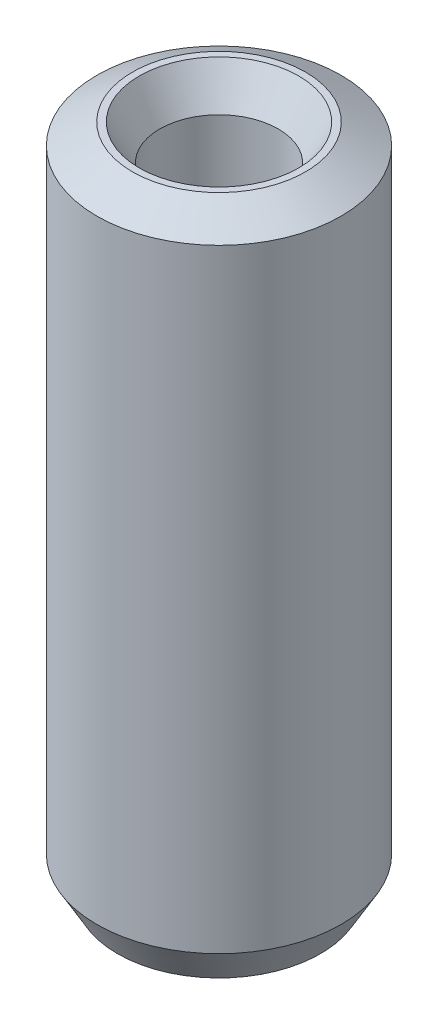
ISO-10303-21;
HEADER;
FILE_DESCRIPTION(('STEP AP214'),'2;1');
FILE_NAME('part.step','',(''),(''),'','','');
FILE_SCHEMA(('AUTOMOTIVE_DESIGN { 1 0 10303 214 1 1 1 1 }'));
ENDSEC;
DATA;
#1=APPLICATION_CONTEXT('core data for automotive mechanical design processes');
#2=APPLICATION_PROTOCOL_DEFINITION('international standard','automotive_design',2000,#1);
#3=PRODUCT_CONTEXT('',#1,'mechanical');
#4=PRODUCT('Part','Part','',(#3));
#5=PRODUCT_RELATED_PRODUCT_CATEGORY('part','',(#4));
#6=PRODUCT_DEFINITION_FORMATION('','',#4);
#7=PRODUCT_DEFINITION_CONTEXT('part definition',#1,'design');
#8=PRODUCT_DEFINITION('design','',#6,#7);
#9=PRODUCT_DEFINITION_SHAPE('','',#8);
#10=(LENGTH_UNIT() NAMED_UNIT(*) SI_UNIT(.MILLI.,.METRE.));
#11=(NAMED_UNIT(*) PLANE_ANGLE_UNIT() SI_UNIT($,.RADIAN.));
#12=(NAMED_UNIT(*) SI_UNIT($,.STERADIAN.) SOLID_ANGLE_UNIT());
#13=UNCERTAINTY_MEASURE_WITH_UNIT(LENGTH_MEASURE(1.E-05),#10,'distance_accuracy_value','');
#14=(GEOMETRIC_REPRESENTATION_CONTEXT(3) GLOBAL_UNCERTAINTY_ASSIGNED_CONTEXT((#13)) GLOBAL_UNIT_ASSIGNED_CONTEXT((#10,
#11,#12)) REPRESENTATION_CONTEXT('',''));
#15=CARTESIAN_POINT('',(0.,0.,0.));
#16=DIRECTION('',(0.,0.,1.));
#17=DIRECTION('',(1.,0.,0.));
#18=AXIS2_PLACEMENT_3D('',#15,#16,#17);
#19=CARTESIAN_POINT('',(0.,95.9807842280937,0.));
#20=DIRECTION('',(0.,-1.,0.));
#21=DIRECTION('',(0.,0.,-1.));
#22=AXIS2_PLACEMENT_3D('',#19,#20,#21);
#23=CYLINDRICAL_SURFACE('',#22,17.5);
#24=CARTESIAN_POINT('',(0.,5.09988005060051,0.));
#25=DIRECTION('',(0.,1.,0.));
#26=DIRECTION('',(0.,0.,1.));
#27=AXIS2_PLACEMENT_3D('',#24,#25,#26);
#28=CIRCLE('',#27,17.5);
#29=CARTESIAN_POINT('',(0.,5.09988005060051,-17.5));
#30=VERTEX_POINT('',#29);
#31=EDGE_CURVE('E10',#30,#30,#28,.T.);
#32=CARTESIAN_POINT('',(0.,93.0363671080448,0.));
#33=DIRECTION('',(0.,1.,0.));
#34=DIRECTION('',(0.,0.,1.));
#35=AXIS2_PLACEMENT_3D('',#32,#33,#34);
#36=CIRCLE('',#35,17.5);
#37=CARTESIAN_POINT('',(0.,93.0363671080448,-17.5));
#38=VERTEX_POINT('',#37);
#39=EDGE_CURVE('E50',#38,#38,#36,.F.);
#40=CARTESIAN_POINT('',(0.,5.09988005060051,-17.5));
#41=CARTESIAN_POINT('',(0.,6.01588512411555,-17.5));
#42=CARTESIAN_POINT('',(0.,6.9318901976306,-17.5));
#43=CARTESIAN_POINT('',(0.,8.76390034466069,-17.5));
#44=CARTESIAN_POINT('',(0.,9.67990541817573,-17.5));
#45=CARTESIAN_POINT('',(0.,11.5119155652058,-17.5));
#46=CARTESIAN_POINT('',(0.,12.4279206387209,-17.5));
#47=CARTESIAN_POINT('',(0.,14.259930785751,-17.5));
#48=CARTESIAN_POINT('',(0.,15.175935859266,-17.5));
#49=CARTESIAN_POINT('',(0.,17.0079460062961,-17.5));
#50=CARTESIAN_POINT('',(0.,17.9239510798111,-17.5));
#51=CARTESIAN_POINT('',(0.,19.7559612268412,-17.5));
#52=CARTESIAN_POINT('',(0.,20.6719663003563,-17.5));
#53=CARTESIAN_POINT('',(0.,22.5039764473864,-17.5));
#54=CARTESIAN_POINT('',(0.,23.4199815209014,-17.5));
#55=CARTESIAN_POINT('',(0.,25.2519916679315,-17.5));
#56=CARTESIAN_POINT('',(0.,26.1679967414465,-17.5));
#57=CARTESIAN_POINT('',(0.,28.0000068884766,-17.5));
#58=CARTESIAN_POINT('',(0.,28.9160119619917,-17.5));
#59=CARTESIAN_POINT('',(0.,30.7480221090218,-17.5));
#60=CARTESIAN_POINT('',(0.,31.6640271825368,-17.5));
#61=CARTESIAN_POINT('',(0.,33.4960373295669,-17.5));
#62=CARTESIAN_POINT('',(0.,34.4120424030819,-17.5));
#63=CARTESIAN_POINT('',(0.,36.244052550112,-17.5));
#64=CARTESIAN_POINT('',(0.,37.1600576236271,-17.5));
#65=CARTESIAN_POINT('',(0.,38.9920677706572,-17.5));
#66=CARTESIAN_POINT('',(0.,39.9080728441722,-17.5));
#67=CARTESIAN_POINT('',(0.,41.7400829912023,-17.5));
#68=CARTESIAN_POINT('',(0.,42.6560880647173,-17.5));
#69=CARTESIAN_POINT('',(0.,44.4880982117474,-17.5));
#70=CARTESIAN_POINT('',(0.,45.4041032852625,-17.5));
#71=CARTESIAN_POINT('',(0.,47.2361134322926,-17.5));
#72=CARTESIAN_POINT('',(0.,48.1521185058076,-17.5));
#73=CARTESIAN_POINT('',(0.,49.9841286528377,-17.5));
#74=CARTESIAN_POINT('',(0.,50.9001337263527,-17.5));
#75=CARTESIAN_POINT('',(0.,52.7321438733828,-17.5));
#76=CARTESIAN_POINT('',(0.,53.6481489468979,-17.5));
#77=CARTESIAN_POINT('',(0.,55.480159093928,-17.5));
#78=CARTESIAN_POINT('',(0.,56.396164167443,-17.5));
#79=CARTESIAN_POINT('',(0.,58.2281743144731,-17.5));
#80=CARTESIAN_POINT('',(0.,59.1441793879881,-17.5));
#81=CARTESIAN_POINT('',(0.,60.9761895350182,-17.5));
#82=CARTESIAN_POINT('',(0.,61.8921946085333,-17.5));
#83=CARTESIAN_POINT('',(0.,63.7242047555633,-17.5));
#84=CARTESIAN_POINT('',(0.,64.6402098290784,-17.5));
#85=CARTESIAN_POINT('',(0.,66.4722199761085,-17.5));
#86=CARTESIAN_POINT('',(0.,67.3882250496235,-17.5));
#87=CARTESIAN_POINT('',(0.,69.2202351966536,-17.5));
#88=CARTESIAN_POINT('',(0.,70.1362402701687,-17.5));
#89=CARTESIAN_POINT('',(0.,71.9682504171987,-17.5));
#90=CARTESIAN_POINT('',(0.,72.8842554907138,-17.5));
#91=CARTESIAN_POINT('',(0.,74.7162656377439,-17.5));
#92=CARTESIAN_POINT('',(0.,75.6322707112589,-17.5));
#93=CARTESIAN_POINT('',(0.,77.464280858289,-17.5));
#94=CARTESIAN_POINT('',(0.,78.3802859318041,-17.5));
#95=CARTESIAN_POINT('',(0.,80.2122960788341,-17.5));
#96=CARTESIAN_POINT('',(0.,81.1283011523492,-17.5));
#97=CARTESIAN_POINT('',(0.,82.9603112993793,-17.5));
#98=CARTESIAN_POINT('',(0.,83.8763163728943,-17.5));
#99=CARTESIAN_POINT('',(0.,85.7083265199244,-17.5));
#100=CARTESIAN_POINT('',(0.,86.6243315934395,-17.5));
#101=CARTESIAN_POINT('',(0.,88.4563417404695,-17.5));
#102=CARTESIAN_POINT('',(0.,89.3723468139846,-17.5));
#103=CARTESIAN_POINT('',(0.,91.2043569610147,-17.5));
#104=CARTESIAN_POINT('',(0.,92.1203620345297,-17.5));
#105=CARTESIAN_POINT('',(0.,93.0363671080448,-17.5));
#106=B_SPLINE_CURVE_WITH_KNOTS('',3,(#40,#41,#42,#43,#44,#45,#46,#47,#48,#49,#50,#51,#52,#53,
#54,#55,#56,#57,#58,#59,#60,#61,#62,#63,#64,#65,#66,#67,#68,#69,#70,#71,#72,#73,#74,#75,#76,#77,
#78,#79,#80,#81,#82,#83,#84,#85,#86,#87,#88,#89,#90,#91,#92,#93,#94,#95,#96,#97,#98,#99,#100,
#101,#102,#103,#104,#105),.UNSPECIFIED.,.F.,.F.,(4,2,2,2,2,2,2,2,2,2,2,2,2,2,2,2,2,2,2,2,2,2,2,
2,2,2,2,2,2,2,2,2,4),(0.,2.74801522054513,5.49603044109026,8.2440456616354,10.9920608821805,
13.7400761027257,16.4880913232708,19.2361065438159,21.9841217643611,24.7321369849062,
27.4801522054513,30.2281674259965,32.9761826465416,35.7241978670867,38.4722130876319,
41.220228308177,43.9682435287221,46.7162587492673,49.4642739698124,52.2122891903575,
54.9603044109027,57.7083196314478,60.4563348519929,63.204350072538,65.9523652930832,
68.7003805136283,71.4483957341735,74.1964109547186,76.9444261752637,79.6924413958088,
82.440456616354,85.1884718368991,87.9364870574443),.UNSPECIFIED.);
#107=EDGE_CURVE('BSEAM39',#30,#38,#106,.T.);
#108=ORIENTED_EDGE('',*,*,#31,.T.);
#109=ORIENTED_EDGE('',*,*,#39,.T.);
#110=ORIENTED_EDGE('',*,*,#107,.T.);
#111=ORIENTED_EDGE('',*,*,#107,.F.);
#112=EDGE_LOOP('',(#108,#110,#109,#111));
#113=FACE_BOUND('',#112,.T.);
#114=ADVANCED_FACE('F39',(#113),#23,.T.);
#115=CARTESIAN_POINT('',(0.,95.9807842280937,0.));
#116=DIRECTION('',(0.,1.,0.));
#117=DIRECTION('',(0.,0.,1.));
#118=AXIS2_PLACEMENT_3D('',#115,#116,#117);
#119=PLANE('',#118);
#120=CARTESIAN_POINT('',(0.,95.9807842280937,0.));
#121=DIRECTION('',(0.,1.,0.));
#122=DIRECTION('',(0.,0.,1.));
#123=AXIS2_PLACEMENT_3D('',#120,#121,#122);
#124=CIRCLE('',#123,11.4274088536523);
#125=CARTESIAN_POINT('',(0.,95.9807842280937,11.4274088536523));
#126=VERTEX_POINT('',#125);
#127=EDGE_CURVE('E58',#126,#126,#124,.F.);
#128=ORIENTED_EDGE('',*,*,#127,.T.);
#129=EDGE_LOOP('',(#128));
#130=FACE_BOUND('',#129,.T.);
#131=CARTESIAN_POINT('',(0.,95.9807842280937,0.));
#132=DIRECTION('',(0.,1.,0.));
#133=DIRECTION('',(0.,0.,1.));
#134=AXIS2_PLACEMENT_3D('',#131,#132,#133);
#135=CIRCLE('',#134,12.4001199493998);
#136=CARTESIAN_POINT('',(0.,95.9807842280937,12.4001199493998));
#137=VERTEX_POINT('',#136);
#138=EDGE_CURVE('E61',#137,#137,#135,.T.);
#139=ORIENTED_EDGE('',*,*,#138,.T.);
#140=EDGE_LOOP('',(#139));
#141=FACE_BOUND('',#140,.T.);
#142=ADVANCED_FACE('F88',(#130,#141),#119,.T.);
#143=CARTESIAN_POINT('',(0.,0.,0.));
#144=DIRECTION('',(0.,1.,0.));
#145=DIRECTION('',(0.,0.,1.));
#146=AXIS2_PLACEMENT_3D('',#143,#144,#145);
#147=PLANE('',#146);
#148=CARTESIAN_POINT('',(0.,0.,0.));
#149=DIRECTION('',(0.,1.,0.));
#150=DIRECTION('',(0.,0.,1.));
#151=AXIS2_PLACEMENT_3D('',#148,#149,#150);
#152=CIRCLE('',#151,13.5828717842035);
#153=CARTESIAN_POINT('',(0.,0.,13.5828717842035));
#154=VERTEX_POINT('',#153);
#155=EDGE_CURVE('E51',#154,#154,#152,.T.);
#156=ORIENTED_EDGE('',*,*,#155,.T.);
#157=EDGE_LOOP('',(#156));
#158=FACE_BOUND('',#157,.T.);
#159=CARTESIAN_POINT('',(0.,0.,0.));
#160=DIRECTION('',(0.,1.,0.));
#161=DIRECTION('',(0.,0.,1.));
#162=AXIS2_PLACEMENT_3D('',#159,#160,#161);
#163=CIRCLE('',#162,14.555582879951);
#164=CARTESIAN_POINT('',(0.,0.,14.555582879951));
#165=VERTEX_POINT('',#164);
#166=EDGE_CURVE('E54',#165,#165,#163,.F.);
#167=ORIENTED_EDGE('',*,*,#166,.T.);
#168=EDGE_LOOP('',(#167));
#169=FACE_BOUND('',#168,.T.);
#170=ADVANCED_FACE('F83',(#158,#169),#147,.F.);
#171=CARTESIAN_POINT('',(0.,95.9807842280937,0.));
#172=DIRECTION('',(0.,-1.,0.));
#173=DIRECTION('',(0.,0.,-1.));
#174=AXIS2_PLACEMENT_3D('',#171,#172,#173);
#175=CYLINDRICAL_SURFACE('',#174,8.48299173360329);
#176=CARTESIAN_POINT('',(0.,90.8809041774932,0.));
#177=DIRECTION('',(0.,1.,0.));
#178=DIRECTION('',(0.,0.,1.));
#179=AXIS2_PLACEMENT_3D('',#176,#177,#178);
#180=CIRCLE('',#179,8.48299173360329);
#181=CARTESIAN_POINT('',(0.,90.8809041774932,-8.48299173360329));
#182=VERTEX_POINT('',#181);
#183=EDGE_CURVE('E67',#182,#182,#180,.T.);
#184=CARTESIAN_POINT('',(0.,2.94441712004889,0.));
#185=DIRECTION('',(0.,1.,0.));
#186=DIRECTION('',(0.,0.,1.));
#187=AXIS2_PLACEMENT_3D('',#184,#185,#186);
#188=CIRCLE('',#187,8.48299173360329);
#189=CARTESIAN_POINT('',(0.,2.94441712004888,-8.48299173360329));
#190=VERTEX_POINT('',#189);
#191=EDGE_CURVE('E69',#190,#190,#188,.F.);
#192=CARTESIAN_POINT('',(0.,90.8809041774932,-8.48299173360329));
#193=CARTESIAN_POINT('',(0.,89.9648991039782,-8.48299173360329));
#194=CARTESIAN_POINT('',(0.,89.0488940304631,-8.48299173360329));
#195=CARTESIAN_POINT('',(0.,87.216883883433,-8.48299173360329));
#196=CARTESIAN_POINT('',(0.,86.300878809918,-8.48299173360329));
#197=CARTESIAN_POINT('',(0.,84.4688686628879,-8.48299173360329));
#198=CARTESIAN_POINT('',(0.,83.5528635893728,-8.48299173360329));
#199=CARTESIAN_POINT('',(0.,81.7208534423428,-8.48299173360329));
#200=CARTESIAN_POINT('',(0.,80.8048483688277,-8.48299173360329));
#201=CARTESIAN_POINT('',(0.,78.9728382217976,-8.48299173360329));
#202=CARTESIAN_POINT('',(0.,78.0568331482826,-8.48299173360329));
#203=CARTESIAN_POINT('',(0.,76.2248230012525,-8.48299173360329));
#204=CARTESIAN_POINT('',(0.,75.3088179277374,-8.48299173360329));
#205=CARTESIAN_POINT('',(0.,73.4768077807073,-8.48299173360329));
#206=CARTESIAN_POINT('',(0.,72.5608027071923,-8.48299173360329));
#207=CARTESIAN_POINT('',(0.,70.7287925601622,-8.48299173360329));
#208=CARTESIAN_POINT('',(0.,69.8127874866472,-8.48299173360329));
#209=CARTESIAN_POINT('',(0.,67.9807773396171,-8.48299173360329));
#210=CARTESIAN_POINT('',(0.,67.064772266102,-8.48299173360329));
#211=CARTESIAN_POINT('',(0.,65.2327621190719,-8.48299173360329));
#212=CARTESIAN_POINT('',(0.,64.3167570455569,-8.48299173360329));
#213=CARTESIAN_POINT('',(0.,62.4847468985268,-8.48299173360329));
#214=CARTESIAN_POINT('',(0.,61.5687418250118,-8.48299173360329));
#215=CARTESIAN_POINT('',(0.,59.7367316779817,-8.48299173360329));
#216=CARTESIAN_POINT('',(0.,58.8207266044666,-8.48299173360329));
#217=CARTESIAN_POINT('',(0.,56.9887164574365,-8.48299173360329));
#218=CARTESIAN_POINT('',(0.,56.0727113839215,-8.48299173360329));
#219=CARTESIAN_POINT('',(0.,54.2407012368914,-8.48299173360329));
#220=CARTESIAN_POINT('',(0.,53.3246961633764,-8.48299173360329));
#221=CARTESIAN_POINT('',(0.,51.4926860163463,-8.48299173360329));
#222=CARTESIAN_POINT('',(0.,50.5766809428312,-8.48299173360329));
#223=CARTESIAN_POINT('',(0.,48.7446707958011,-8.48299173360329));
#224=CARTESIAN_POINT('',(0.,47.8286657222861,-8.48299173360329));
#225=CARTESIAN_POINT('',(0.,45.996655575256,-8.48299173360329));
#226=CARTESIAN_POINT('',(0.,45.080650501741,-8.48299173360329));
#227=CARTESIAN_POINT('',(0.,43.2486403547109,-8.48299173360329));
#228=CARTESIAN_POINT('',(0.,42.3326352811958,-8.48299173360329));
#229=CARTESIAN_POINT('',(0.,40.5006251341657,-8.48299173360329));
#230=CARTESIAN_POINT('',(0.,39.5846200606507,-8.48299173360329));
#231=CARTESIAN_POINT('',(0.,37.7526099136206,-8.48299173360329));
#232=CARTESIAN_POINT('',(0.,36.8366048401056,-8.48299173360329));
#233=CARTESIAN_POINT('',(0.,35.0045946930755,-8.48299173360329));
#234=CARTESIAN_POINT('',(0.,34.0885896195604,-8.48299173360329));
#235=CARTESIAN_POINT('',(0.,32.2565794725303,-8.48299173360329));
#236=CARTESIAN_POINT('',(0.,31.3405743990153,-8.48299173360329));
#237=CARTESIAN_POINT('',(0.,29.5085642519852,-8.48299173360329));
#238=CARTESIAN_POINT('',(0.,28.5925591784701,-8.48299173360329));
#239=CARTESIAN_POINT('',(0.,26.7605490314401,-8.48299173360329));
#240=CARTESIAN_POINT('',(0.,25.844543957925,-8.48299173360329));
#241=CARTESIAN_POINT('',(0.,24.0125338108949,-8.48299173360329));
#242=CARTESIAN_POINT('',(0.,23.0965287373799,-8.48299173360329));
#243=CARTESIAN_POINT('',(0.,21.2645185903498,-8.48299173360329));
#244=CARTESIAN_POINT('',(0.,20.3485135168347,-8.48299173360329));
#245=CARTESIAN_POINT('',(0.,18.5165033698046,-8.48299173360329));
#246=CARTESIAN_POINT('',(0.,17.6004982962896,-8.48299173360329));
#247=CARTESIAN_POINT('',(0.,15.7684881492595,-8.48299173360329));
#248=CARTESIAN_POINT('',(0.,14.8524830757445,-8.48299173360329));
#249=CARTESIAN_POINT('',(0.,13.0204729287144,-8.48299173360329));
#250=CARTESIAN_POINT('',(0.,12.1044678551993,-8.48299173360329));
#251=CARTESIAN_POINT('',(0.,10.2724577081693,-8.48299173360329));
#252=CARTESIAN_POINT('',(0.,9.35645263465421,-8.48299173360329));
#253=CARTESIAN_POINT('',(0.,7.52444248762411,-8.48299173360329));
#254=CARTESIAN_POINT('',(0.,6.60843741410906,-8.48299173360329));
#255=CARTESIAN_POINT('',(0.,4.77642726707897,-8.48299173360329));
#256=CARTESIAN_POINT('',(0.,3.86042219356392,-8.48299173360329));
#257=CARTESIAN_POINT('',(0.,2.94441712004888,-8.48299173360329));
#258=B_SPLINE_CURVE_WITH_KNOTS('',3,(#192,#193,#194,#195,#196,#197,#198,#199,#200,#201,#202,
#203,#204,#205,#206,#207,#208,#209,#210,#211,#212,#213,#214,#215,#216,#217,#218,#219,#220,#221,
#222,#223,#224,#225,#226,#227,#228,#229,#230,#231,#232,#233,#234,#235,#236,#237,#238,#239,#240,
#241,#242,#243,#244,#245,#246,#247,#248,#249,#250,#251,#252,#253,#254,#255,#256,#257),
.UNSPECIFIED.,.F.,.F.,(4,2,2,2,2,2,2,2,2,2,2,2,2,2,2,2,2,2,2,2,2,2,2,2,2,2,2,2,2,2,2,2,4),(0.,
2.74801522054514,5.49603044109027,8.2440456616354,10.9920608821805,13.7400761027257,
16.4880913232708,19.236106543816,21.9841217643611,24.7321369849062,27.4801522054513,
30.2281674259965,32.9761826465416,35.7241978670868,38.4722130876319,41.220228308177,
43.9682435287222,46.7162587492673,49.4642739698124,52.2122891903576,54.9603044109027,
57.7083196314478,60.456334851993,63.2043500725381,65.9523652930832,68.7003805136284,
71.4483957341735,74.1964109547187,76.9444261752638,79.6924413958089,82.440456616354,
85.1884718368992,87.9364870574443),.UNSPECIFIED.);
#259=EDGE_CURVE('BSEAM71',#182,#190,#258,.T.);
#260=ORIENTED_EDGE('',*,*,#183,.T.);
#261=ORIENTED_EDGE('',*,*,#191,.T.);
#262=ORIENTED_EDGE('',*,*,#259,.T.);
#263=ORIENTED_EDGE('',*,*,#259,.F.);
#264=EDGE_LOOP('',(#260,#262,#261,#263));
#265=FACE_BOUND('',#264,.T.);
#266=ADVANCED_FACE('F71',(#265),#175,.F.);
#267=CARTESIAN_POINT('',(0.,90.8809041774932,0.));
#268=DIRECTION('',(0.,1.,0.));
#269=DIRECTION('',(0.,0.,1.));
#270=AXIS2_PLACEMENT_3D('',#267,#268,#269);
#271=CONICAL_SURFACE('',#270,8.48299173360329,0.523598775598304);
#272=ORIENTED_EDGE('',*,*,#127,.F.);
#273=EDGE_LOOP('',(#272));
#274=FACE_BOUND('',#273,.T.);
#275=ORIENTED_EDGE('',*,*,#183,.F.);
#276=EDGE_LOOP('',(#275));
#277=FACE_BOUND('',#276,.T.);
#278=ADVANCED_FACE('F77',(#274,#277),#271,.F.);
#279=CARTESIAN_POINT('',(0.,0.,0.));
#280=DIRECTION('',(0.,-1.,0.));
#281=DIRECTION('',(0.,0.,-1.));
#282=AXIS2_PLACEMENT_3D('',#279,#280,#281);
#283=CONICAL_SURFACE('',#282,13.5828717842035,1.04719755119659);
#284=ORIENTED_EDGE('',*,*,#191,.F.);
#285=EDGE_LOOP('',(#284));
#286=FACE_BOUND('',#285,.T.);
#287=ORIENTED_EDGE('',*,*,#155,.F.);
#288=EDGE_LOOP('',(#287));
#289=FACE_BOUND('',#288,.T.);
#290=ADVANCED_FACE('F73',(#286,#289),#283,.F.);
#291=CARTESIAN_POINT('',(0.,5.09988005060051,0.));
#292=DIRECTION('',(0.,1.,0.));
#293=DIRECTION('',(0.,0.,1.));
#294=AXIS2_PLACEMENT_3D('',#291,#292,#293);
#295=CONICAL_SURFACE('',#294,17.5,0.523598775598302);
#296=ORIENTED_EDGE('',*,*,#166,.F.);
#297=EDGE_LOOP('',(#296));
#298=FACE_BOUND('',#297,.T.);
#299=ORIENTED_EDGE('',*,*,#31,.F.);
#300=EDGE_LOOP('',(#299));
#301=FACE_BOUND('',#300,.T.);
#302=ADVANCED_FACE('F76',(#298,#301),#295,.T.);
#303=CARTESIAN_POINT('',(0.,95.9807842280937,0.));
#304=DIRECTION('',(0.,-1.,0.));
#305=DIRECTION('',(0.,0.,-1.));
#306=AXIS2_PLACEMENT_3D('',#303,#304,#305);
#307=CONICAL_SURFACE('',#306,12.4001199493998,1.04719755119659);
#308=ORIENTED_EDGE('',*,*,#39,.F.);
#309=EDGE_LOOP('',(#308));
#310=FACE_BOUND('',#309,.T.);
#311=ORIENTED_EDGE('',*,*,#138,.F.);
#312=EDGE_LOOP('',(#311));
#313=FACE_BOUND('',#312,.T.);
#314=ADVANCED_FACE('F45',(#310,#313),#307,.T.);
#315=CLOSED_SHELL('',(#114,#142,#170,#266,#278,#290,#302,#314));
#316=MANIFOLD_SOLID_BREP('B2',#315);
#317=ADVANCED_BREP_SHAPE_REPRESENTATION('',(#18,#316),#14);
#318=SHAPE_DEFINITION_REPRESENTATION(#9,#317);
ENDSEC;
END-ISO-10303-21;
